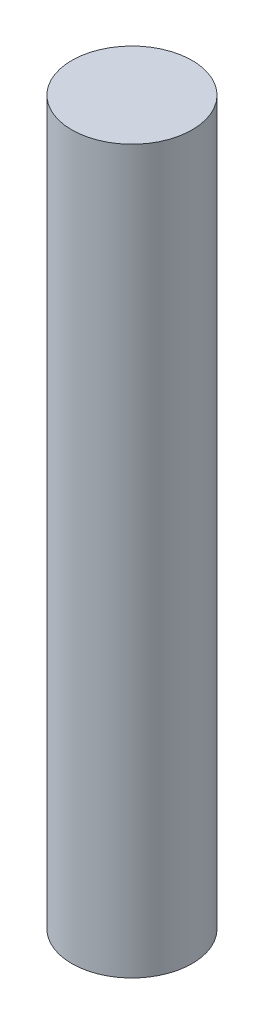
ISO-10303-21;
HEADER;
FILE_DESCRIPTION(('STEP AP214'),'2;1');
FILE_NAME('part.step','',(''),(''),'','','');
FILE_SCHEMA(('AUTOMOTIVE_DESIGN { 1 0 10303 214 1 1 1 1 }'));
ENDSEC;
DATA;
#1=APPLICATION_CONTEXT('core data for automotive mechanical design processes');
#2=APPLICATION_PROTOCOL_DEFINITION('international standard','automotive_design',2000,#1);
#3=PRODUCT_CONTEXT('',#1,'mechanical');
#4=PRODUCT('Part','Part','',(#3));
#5=PRODUCT_RELATED_PRODUCT_CATEGORY('part','',(#4));
#6=PRODUCT_DEFINITION_FORMATION('','',#4);
#7=PRODUCT_DEFINITION_CONTEXT('part definition',#1,'design');
#8=PRODUCT_DEFINITION('design','',#6,#7);
#9=PRODUCT_DEFINITION_SHAPE('','',#8);
#10=(LENGTH_UNIT() NAMED_UNIT(*) SI_UNIT(.MILLI.,.METRE.));
#11=(NAMED_UNIT(*) PLANE_ANGLE_UNIT() SI_UNIT($,.RADIAN.));
#12=(NAMED_UNIT(*) SI_UNIT($,.STERADIAN.) SOLID_ANGLE_UNIT());
#13=UNCERTAINTY_MEASURE_WITH_UNIT(LENGTH_MEASURE(1.E-05),#10,'distance_accuracy_value','');
#14=(GEOMETRIC_REPRESENTATION_CONTEXT(3) GLOBAL_UNCERTAINTY_ASSIGNED_CONTEXT((#13)) GLOBAL_UNIT_ASSIGNED_CONTEXT((#10,
#11,#12)) REPRESENTATION_CONTEXT('',''));
#15=CARTESIAN_POINT('',(0.,0.,0.));
#16=DIRECTION('',(0.,0.,1.));
#17=DIRECTION('',(1.,0.,0.));
#18=AXIS2_PLACEMENT_3D('',#15,#16,#17);
#19=CARTESIAN_POINT('',(0.,152.4,0.));
#20=DIRECTION('',(0.,-1.,0.));
#21=DIRECTION('',(0.,0.,-1.));
#22=AXIS2_PLACEMENT_3D('',#19,#20,#21);
#23=CYLINDRICAL_SURFACE('',#22,12.7);
#24=CARTESIAN_POINT('',(0.,152.4,0.));
#25=DIRECTION('',(0.,1.,0.));
#26=DIRECTION('',(0.,0.,1.));
#27=AXIS2_PLACEMENT_3D('',#24,#25,#26);
#28=CIRCLE('',#27,12.7);
#29=CARTESIAN_POINT('',(0.,152.4,12.7));
#30=VERTEX_POINT('',#29);
#31=EDGE_CURVE('E10',#30,#30,#28,.T.);
#32=ORIENTED_EDGE('',*,*,#31,.F.);
#33=EDGE_LOOP('',(#32));
#34=FACE_BOUND('',#33,.T.);
#35=CARTESIAN_POINT('',(0.,0.,0.));
#36=DIRECTION('',(0.,1.,0.));
#37=DIRECTION('',(0.,0.,1.));
#38=AXIS2_PLACEMENT_3D('',#35,#36,#37);
#39=CIRCLE('',#38,12.7);
#40=CARTESIAN_POINT('',(0.,0.,12.7));
#41=VERTEX_POINT('',#40);
#42=EDGE_CURVE('E37',#41,#41,#39,.T.);
#43=ORIENTED_EDGE('',*,*,#42,.T.);
#44=EDGE_LOOP('',(#43));
#45=FACE_BOUND('',#44,.T.);
#46=ADVANCED_FACE('F34',(#34,#45),#23,.T.);
#47=CARTESIAN_POINT('',(0.,152.4,0.));
#48=DIRECTION('',(0.,1.,0.));
#49=DIRECTION('',(0.,0.,1.));
#50=AXIS2_PLACEMENT_3D('',#47,#48,#49);
#51=PLANE('',#50);
#52=ORIENTED_EDGE('',*,*,#31,.T.);
#53=EDGE_LOOP('',(#52));
#54=FACE_BOUND('',#53,.T.);
#55=ADVANCED_FACE('F49',(#54),#51,.T.);
#56=CARTESIAN_POINT('',(0.,0.,0.));
#57=DIRECTION('',(0.,1.,0.));
#58=DIRECTION('',(0.,0.,1.));
#59=AXIS2_PLACEMENT_3D('',#56,#57,#58);
#60=PLANE('',#59);
#61=ORIENTED_EDGE('',*,*,#42,.F.);
#62=EDGE_LOOP('',(#61));
#63=FACE_BOUND('',#62,.T.);
#64=ADVANCED_FACE('F47',(#63),#60,.F.);
#65=CLOSED_SHELL('',(#46,#55,#64));
#66=MANIFOLD_SOLID_BREP('B2',#65);
#67=ADVANCED_BREP_SHAPE_REPRESENTATION('',(#18,#66),#14);
#68=SHAPE_DEFINITION_REPRESENTATION(#9,#67);
ENDSEC;
END-ISO-10303-21;
